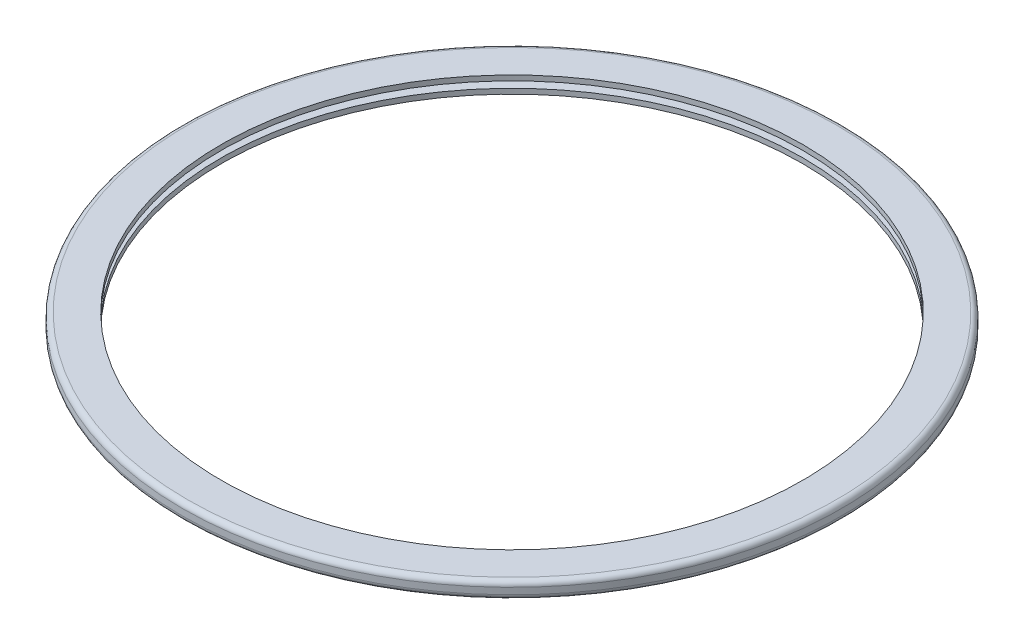
ISO-10303-21;
HEADER;
FILE_DESCRIPTION(('STEP AP214'),'2;1');
FILE_NAME('part.step','',(''),(''),'','','');
FILE_SCHEMA(('AUTOMOTIVE_DESIGN { 1 0 10303 214 1 1 1 1 }'));
ENDSEC;
DATA;
#1=APPLICATION_CONTEXT('core data for automotive mechanical design processes');
#2=APPLICATION_PROTOCOL_DEFINITION('international standard','automotive_design',2000,#1);
#3=PRODUCT_CONTEXT('',#1,'mechanical');
#4=PRODUCT('Part','Part','',(#3));
#5=PRODUCT_RELATED_PRODUCT_CATEGORY('part','',(#4));
#6=PRODUCT_DEFINITION_FORMATION('','',#4);
#7=PRODUCT_DEFINITION_CONTEXT('part definition',#1,'design');
#8=PRODUCT_DEFINITION('design','',#6,#7);
#9=PRODUCT_DEFINITION_SHAPE('','',#8);
#10=(LENGTH_UNIT() NAMED_UNIT(*) SI_UNIT(.MILLI.,.METRE.));
#11=(NAMED_UNIT(*) PLANE_ANGLE_UNIT() SI_UNIT($,.RADIAN.));
#12=(NAMED_UNIT(*) SI_UNIT($,.STERADIAN.) SOLID_ANGLE_UNIT());
#13=UNCERTAINTY_MEASURE_WITH_UNIT(LENGTH_MEASURE(1.E-05),#10,'distance_accuracy_value','');
#14=(GEOMETRIC_REPRESENTATION_CONTEXT(3) GLOBAL_UNCERTAINTY_ASSIGNED_CONTEXT((#13)) GLOBAL_UNIT_ASSIGNED_CONTEXT((#10,
#11,#12)) REPRESENTATION_CONTEXT('',''));
#15=CARTESIAN_POINT('',(0.,0.,0.));
#16=DIRECTION('',(0.,0.,1.));
#17=DIRECTION('',(1.,0.,0.));
#18=AXIS2_PLACEMENT_3D('',#15,#16,#17);
#19=CARTESIAN_POINT('',(0.,-2.38125,0.));
#20=DIRECTION('',(0.,-1.,0.));
#21=DIRECTION('',(0.,0.,-1.));
#22=AXIS2_PLACEMENT_3D('',#19,#20,#21);
#23=TOROIDAL_SURFACE('',#22,241.3,3.80999999999999);
#24=CARTESIAN_POINT('',(0.,-2.38125,0.));
#25=DIRECTION('',(0.,-1.,0.));
#26=DIRECTION('',(0.,0.,-1.));
#27=AXIS2_PLACEMENT_3D('',#24,#25,#26);
#28=CIRCLE('',#27,245.11);
#29=CARTESIAN_POINT('',(0.,-2.38125,-245.11));
#30=VERTEX_POINT('',#29);
#31=EDGE_CURVE('E51',#30,#30,#28,.F.);
#32=ORIENTED_EDGE('',*,*,#31,.F.);
#33=EDGE_LOOP('',(#32));
#34=FACE_BOUND('',#33,.T.);
#35=CARTESIAN_POINT('',(0.,-6.19124999999999,0.));
#36=DIRECTION('',(0.,1.,0.));
#37=DIRECTION('',(0.,0.,-1.));
#38=AXIS2_PLACEMENT_3D('',#35,#36,#37);
#39=CIRCLE('',#38,241.3);
#40=CARTESIAN_POINT('',(0.,-6.19124999999999,241.3));
#41=VERTEX_POINT('',#40);
#42=CARTESIAN_POINT('',(0.,-6.19124999999999,-241.3));
#43=VERTEX_POINT('',#42);
#44=EDGE_CURVE('E47',#41,#43,#39,.F.);
#45=ORIENTED_EDGE('',*,*,#44,.F.);
#46=CARTESIAN_POINT('',(0.,-6.19124999999999,0.));
#47=DIRECTION('',(0.,1.,0.));
#48=DIRECTION('',(0.,0.,1.));
#49=AXIS2_PLACEMENT_3D('',#46,#47,#48);
#50=CIRCLE('',#49,241.3);
#51=EDGE_CURVE('E45',#43,#41,#50,.F.);
#52=ORIENTED_EDGE('',*,*,#51,.F.);
#53=EDGE_LOOP('',(#45,#52));
#54=FACE_BOUND('',#53,.T.);
#55=ADVANCED_FACE('F16',(#34,#54),#23,.T.);
#56=CARTESIAN_POINT('',(216.3,-6.19125,0.));
#57=DIRECTION('',(0.,-1.,0.));
#58=DIRECTION('',(0.,0.,-1.));
#59=AXIS2_PLACEMENT_3D('',#56,#57,#58);
#60=PLANE('',#59);
#61=CARTESIAN_POINT('',(0.,-6.19125,0.));
#62=DIRECTION('',(0.,-1.,0.));
#63=DIRECTION('',(0.,0.,-1.));
#64=AXIS2_PLACEMENT_3D('',#61,#62,#63);
#65=CIRCLE('',#64,216.3);
#66=CARTESIAN_POINT('',(0.,-6.19125,-216.3));
#67=VERTEX_POINT('',#66);
#68=EDGE_CURVE('E84',#67,#67,#65,.F.);
#69=ORIENTED_EDGE('',*,*,#68,.T.);
#70=EDGE_LOOP('',(#69));
#71=FACE_BOUND('',#70,.T.);
#72=ORIENTED_EDGE('',*,*,#51,.T.);
#73=ORIENTED_EDGE('',*,*,#44,.T.);
#74=EDGE_LOOP('',(#72,#73));
#75=FACE_BOUND('',#74,.T.);
#76=ADVANCED_FACE('F55',(#71,#75),#60,.T.);
#77=CARTESIAN_POINT('',(0.,0.,0.));
#78=DIRECTION('',(0.,-1.,0.));
#79=DIRECTION('',(0.,0.,-1.));
#80=AXIS2_PLACEMENT_3D('',#77,#78,#79);
#81=CYLINDRICAL_SURFACE('',#80,245.11);
#82=CARTESIAN_POINT('',(0.,2.38125,0.));
#83=DIRECTION('',(0.,-1.,0.));
#84=DIRECTION('',(0.,0.,-1.));
#85=AXIS2_PLACEMENT_3D('',#82,#83,#84);
#86=CIRCLE('',#85,245.11);
#87=CARTESIAN_POINT('',(0.,2.38125,-245.11));
#88=VERTEX_POINT('',#87);
#89=EDGE_CURVE('E58',#88,#88,#86,.F.);
#90=ORIENTED_EDGE('',*,*,#89,.F.);
#91=EDGE_LOOP('',(#90));
#92=FACE_BOUND('',#91,.T.);
#93=ORIENTED_EDGE('',*,*,#31,.T.);
#94=EDGE_LOOP('',(#93));
#95=FACE_BOUND('',#94,.T.);
#96=ADVANCED_FACE('F71',(#92,#95),#81,.T.);
#97=CARTESIAN_POINT('',(0.,0.,0.));
#98=DIRECTION('',(0.,-1.,0.));
#99=DIRECTION('',(0.,0.,-1.));
#100=AXIS2_PLACEMENT_3D('',#97,#98,#99);
#101=CYLINDRICAL_SURFACE('',#100,216.3);
#102=ORIENTED_EDGE('',*,*,#68,.F.);
#103=EDGE_LOOP('',(#102));
#104=FACE_BOUND('',#103,.T.);
#105=CARTESIAN_POINT('',(0.,-2.38125,0.));
#106=DIRECTION('',(0.,-1.,0.));
#107=DIRECTION('',(0.,0.,-1.));
#108=AXIS2_PLACEMENT_3D('',#105,#106,#107);
#109=CIRCLE('',#108,216.3);
#110=CARTESIAN_POINT('',(0.,-2.38125,-216.3));
#111=VERTEX_POINT('',#110);
#112=EDGE_CURVE('E91',#111,#111,#109,.T.);
#113=ORIENTED_EDGE('',*,*,#112,.F.);
#114=EDGE_LOOP('',(#113));
#115=FACE_BOUND('',#114,.T.);
#116=ADVANCED_FACE('F111',(#104,#115),#101,.F.);
#117=CARTESIAN_POINT('',(0.,2.38125,0.));
#118=DIRECTION('',(0.,-1.,0.));
#119=DIRECTION('',(0.,0.,-1.));
#120=AXIS2_PLACEMENT_3D('',#117,#118,#119);
#121=TOROIDAL_SURFACE('',#120,241.3,3.81);
#122=CARTESIAN_POINT('',(0.,6.19125,0.));
#123=DIRECTION('',(0.,-1.,0.));
#124=DIRECTION('',(0.,0.,-1.));
#125=AXIS2_PLACEMENT_3D('',#122,#123,#124);
#126=CIRCLE('',#125,241.3);
#127=CARTESIAN_POINT('',(0.,6.19125,241.3));
#128=VERTEX_POINT('',#127);
#129=CARTESIAN_POINT('',(0.,6.19125,-241.3));
#130=VERTEX_POINT('',#129);
#131=EDGE_CURVE('E96',#128,#130,#126,.F.);
#132=ORIENTED_EDGE('',*,*,#131,.F.);
#133=CARTESIAN_POINT('',(0.,6.19125,0.));
#134=DIRECTION('',(0.,-1.,0.));
#135=DIRECTION('',(0.,0.,1.));
#136=AXIS2_PLACEMENT_3D('',#133,#134,#135);
#137=CIRCLE('',#136,241.3);
#138=EDGE_CURVE('E36',#130,#128,#137,.F.);
#139=ORIENTED_EDGE('',*,*,#138,.F.);
#140=EDGE_LOOP('',(#132,#139));
#141=FACE_BOUND('',#140,.T.);
#142=ORIENTED_EDGE('',*,*,#89,.T.);
#143=EDGE_LOOP('',(#142));
#144=FACE_BOUND('',#143,.T.);
#145=ADVANCED_FACE('F100',(#141,#144),#121,.T.);
#146=CARTESIAN_POINT('',(241.3,-2.38125,0.));
#147=DIRECTION('',(0.,1.,0.));
#148=DIRECTION('',(0.,0.,1.));
#149=AXIS2_PLACEMENT_3D('',#146,#147,#148);
#150=PLANE('',#149);
#151=CARTESIAN_POINT('',(0.,-2.38125,0.));
#152=DIRECTION('',(0.,-1.,0.));
#153=DIRECTION('',(0.,0.,-1.));
#154=AXIS2_PLACEMENT_3D('',#151,#152,#153);
#155=CIRCLE('',#154,241.3);
#156=CARTESIAN_POINT('',(0.,-2.38125,-241.3));
#157=VERTEX_POINT('',#156);
#158=EDGE_CURVE('E149',#157,#157,#155,.F.);
#159=ORIENTED_EDGE('',*,*,#158,.T.);
#160=EDGE_LOOP('',(#159));
#161=FACE_BOUND('',#160,.T.);
#162=ORIENTED_EDGE('',*,*,#112,.T.);
#163=EDGE_LOOP('',(#162));
#164=FACE_BOUND('',#163,.T.);
#165=ADVANCED_FACE('F110',(#161,#164),#150,.T.);
#166=CARTESIAN_POINT('',(241.3,6.19125,0.));
#167=DIRECTION('',(0.,1.,0.));
#168=DIRECTION('',(0.,0.,1.));
#169=AXIS2_PLACEMENT_3D('',#166,#167,#168);
#170=PLANE('',#169);
#171=ORIENTED_EDGE('',*,*,#131,.T.);
#172=ORIENTED_EDGE('',*,*,#138,.T.);
#173=EDGE_LOOP('',(#171,#172));
#174=FACE_BOUND('',#173,.T.);
#175=CARTESIAN_POINT('',(0.,6.19125,0.));
#176=DIRECTION('',(0.,-1.,0.));
#177=DIRECTION('',(0.,0.,-1.));
#178=AXIS2_PLACEMENT_3D('',#175,#176,#177);
#179=CIRCLE('',#178,216.3);
#180=CARTESIAN_POINT('',(0.,6.19125,-216.3));
#181=VERTEX_POINT('',#180);
#182=EDGE_CURVE('E175',#181,#181,#179,.T.);
#183=ORIENTED_EDGE('',*,*,#182,.T.);
#184=EDGE_LOOP('',(#183));
#185=FACE_BOUND('',#184,.T.);
#186=ADVANCED_FACE('F127',(#174,#185),#170,.T.);
#187=CARTESIAN_POINT('',(0.,0.,0.));
#188=DIRECTION('',(0.,-1.,0.));
#189=DIRECTION('',(0.,0.,-1.));
#190=AXIS2_PLACEMENT_3D('',#187,#188,#189);
#191=CYLINDRICAL_SURFACE('',#190,241.3);
#192=ORIENTED_EDGE('',*,*,#158,.F.);
#193=EDGE_LOOP('',(#192));
#194=FACE_BOUND('',#193,.T.);
#195=CARTESIAN_POINT('',(0.,2.38125,0.));
#196=DIRECTION('',(0.,-1.,0.));
#197=DIRECTION('',(0.,0.,-1.));
#198=AXIS2_PLACEMENT_3D('',#195,#196,#197);
#199=CIRCLE('',#198,241.3);
#200=CARTESIAN_POINT('',(0.,2.38125,-241.3));
#201=VERTEX_POINT('',#200);
#202=EDGE_CURVE('E28',#201,#201,#199,.T.);
#203=ORIENTED_EDGE('',*,*,#202,.F.);
#204=EDGE_LOOP('',(#203));
#205=FACE_BOUND('',#204,.T.);
#206=ADVANCED_FACE('F136',(#194,#205),#191,.F.);
#207=CARTESIAN_POINT('',(0.,0.,0.));
#208=DIRECTION('',(0.,-1.,0.));
#209=DIRECTION('',(0.,0.,-1.));
#210=AXIS2_PLACEMENT_3D('',#207,#208,#209);
#211=CYLINDRICAL_SURFACE('',#210,216.3);
#212=CARTESIAN_POINT('',(0.,2.38125,0.));
#213=DIRECTION('',(0.,-1.,0.));
#214=DIRECTION('',(0.,0.,-1.));
#215=AXIS2_PLACEMENT_3D('',#212,#213,#214);
#216=CIRCLE('',#215,216.3);
#217=CARTESIAN_POINT('',(0.,2.38125,-216.3));
#218=VERTEX_POINT('',#217);
#219=EDGE_CURVE('E10',#218,#218,#216,.F.);
#220=ORIENTED_EDGE('',*,*,#219,.F.);
#221=EDGE_LOOP('',(#220));
#222=FACE_BOUND('',#221,.T.);
#223=ORIENTED_EDGE('',*,*,#182,.F.);
#224=EDGE_LOOP('',(#223));
#225=FACE_BOUND('',#224,.T.);
#226=ADVANCED_FACE('F163',(#222,#225),#211,.F.);
#227=CARTESIAN_POINT('',(216.3,2.38125,0.));
#228=DIRECTION('',(0.,-1.,0.));
#229=DIRECTION('',(0.,0.,-1.));
#230=AXIS2_PLACEMENT_3D('',#227,#228,#229);
#231=PLANE('',#230);
#232=ORIENTED_EDGE('',*,*,#219,.T.);
#233=EDGE_LOOP('',(#232));
#234=FACE_BOUND('',#233,.T.);
#235=ORIENTED_EDGE('',*,*,#202,.T.);
#236=EDGE_LOOP('',(#235));
#237=FACE_BOUND('',#236,.T.);
#238=ADVANCED_FACE('F161',(#234,#237),#231,.T.);
#239=CLOSED_SHELL('',(#55,#76,#96,#116,#145,#165,#186,#206,#226,#238));
#240=MANIFOLD_SOLID_BREP('B1',#239);
#241=ADVANCED_BREP_SHAPE_REPRESENTATION('',(#18,#240),#14);
#242=SHAPE_DEFINITION_REPRESENTATION(#9,#241);
ENDSEC;
END-ISO-10303-21;
